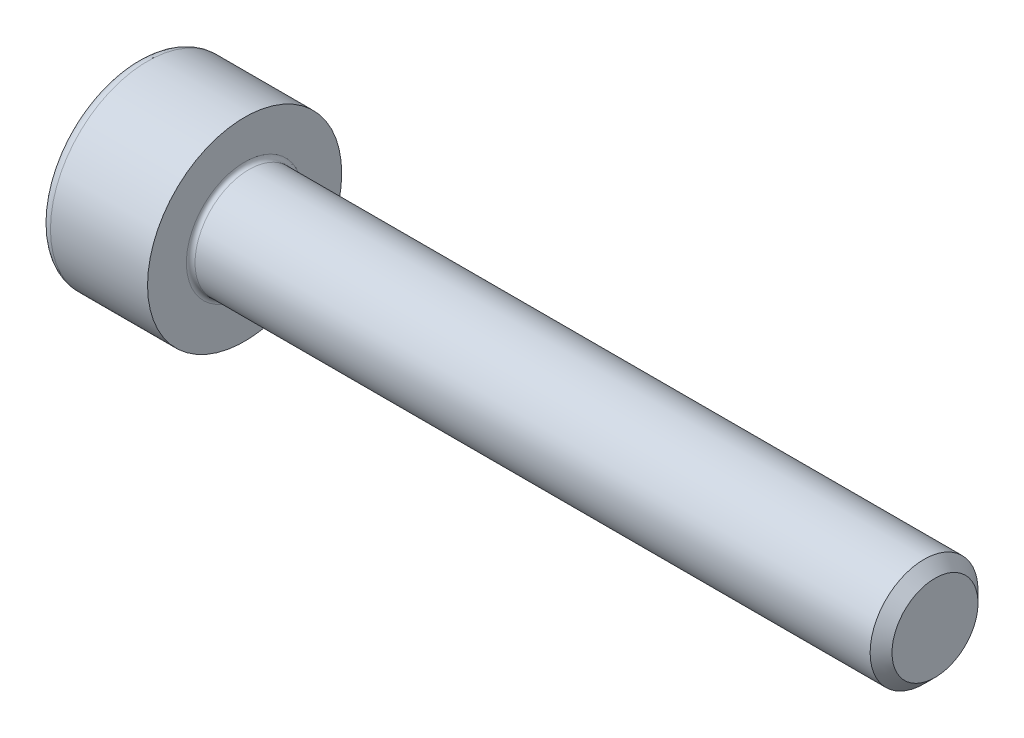
ISO-10303-21;
HEADER;
FILE_DESCRIPTION(('STEP AP214'),'2;1');
FILE_NAME('part.step','',(''),(''),'','','');
FILE_SCHEMA(('AUTOMOTIVE_DESIGN { 1 0 10303 214 1 1 1 1 }'));
ENDSEC;
DATA;
#1=APPLICATION_CONTEXT('core data for automotive mechanical design processes');
#2=APPLICATION_PROTOCOL_DEFINITION('international standard','automotive_design',2000,#1);
#3=PRODUCT_CONTEXT('',#1,'mechanical');
#4=PRODUCT('Part','Part','',(#3));
#5=PRODUCT_RELATED_PRODUCT_CATEGORY('part','',(#4));
#6=PRODUCT_DEFINITION_FORMATION('','',#4);
#7=PRODUCT_DEFINITION_CONTEXT('part definition',#1,'design');
#8=PRODUCT_DEFINITION('design','',#6,#7);
#9=PRODUCT_DEFINITION_SHAPE('','',#8);
#10=(LENGTH_UNIT() NAMED_UNIT(*) SI_UNIT(.MILLI.,.METRE.));
#11=(NAMED_UNIT(*) PLANE_ANGLE_UNIT() SI_UNIT($,.RADIAN.));
#12=(NAMED_UNIT(*) SI_UNIT($,.STERADIAN.) SOLID_ANGLE_UNIT());
#13=UNCERTAINTY_MEASURE_WITH_UNIT(LENGTH_MEASURE(1.E-05),#10,'distance_accuracy_value','');
#14=(GEOMETRIC_REPRESENTATION_CONTEXT(3) GLOBAL_UNCERTAINTY_ASSIGNED_CONTEXT((#13)) GLOBAL_UNIT_ASSIGNED_CONTEXT((#10,
#11,#12)) REPRESENTATION_CONTEXT('',''));
#15=CARTESIAN_POINT('',(0.,0.,0.));
#16=DIRECTION('',(0.,0.,1.));
#17=DIRECTION('',(1.,0.,0.));
#18=AXIS2_PLACEMENT_3D('',#15,#16,#17);
#19=CARTESIAN_POINT('',(0.,0.,0.));
#20=DIRECTION('',(-1.,0.,0.));
#21=DIRECTION('',(0.,0.,1.));
#22=AXIS2_PLACEMENT_3D('',#19,#20,#21);
#23=PLANE('',#22);
#24=DIRECTION('',(0.,-0.499999999999999,0.866025403784439));
#25=VECTOR('',#24,1.);
#26=CARTESIAN_POINT('',(0.,1.16624754376304,0.));
#27=LINE('',#26,#25);
#28=CARTESIAN_POINT('',(0.,1.16624754376304,0.));
#29=VERTEX_POINT('',#28);
#30=CARTESIAN_POINT('',(0.,0.583123771881518,1.01));
#31=VERTEX_POINT('',#30);
#32=EDGE_CURVE('E263',#29,#31,#27,.T.);
#33=ORIENTED_EDGE('',*,*,#32,.T.);
#34=DIRECTION('',(0.,1.,0.));
#35=VECTOR('',#34,1.);
#36=CARTESIAN_POINT('',(0.,-0.583123771881526,1.01));
#37=LINE('',#36,#35);
#38=CARTESIAN_POINT('',(0.,-0.583123771881526,1.01));
#39=VERTEX_POINT('',#38);
#40=EDGE_CURVE('E135',#39,#31,#37,.T.);
#41=ORIENTED_EDGE('',*,*,#40,.F.);
#42=DIRECTION('',(0.,-0.500000000000001,-0.866025403784438));
#43=VECTOR('',#42,1.);
#44=CARTESIAN_POINT('',(0.,-0.583123771881526,1.01));
#45=LINE('',#44,#43);
#46=CARTESIAN_POINT('',(0.,-1.16624754376305,0.));
#47=VERTEX_POINT('',#46);
#48=EDGE_CURVE('E266',#39,#47,#45,.T.);
#49=ORIENTED_EDGE('',*,*,#48,.T.);
#50=DIRECTION('',(0.,0.499999999999999,-0.866025403784439));
#51=VECTOR('',#50,1.);
#52=CARTESIAN_POINT('',(0.,-1.16624754376305,0.));
#53=LINE('',#52,#51);
#54=CARTESIAN_POINT('',(0.,-0.583123771881529,-1.01));
#55=VERTEX_POINT('',#54);
#56=EDGE_CURVE('E269',#47,#55,#53,.T.);
#57=ORIENTED_EDGE('',*,*,#56,.T.);
#58=DIRECTION('',(0.,-1.,0.));
#59=VECTOR('',#58,1.);
#60=CARTESIAN_POINT('',(0.,0.583123771881516,-1.01));
#61=LINE('',#60,#59);
#62=CARTESIAN_POINT('',(0.,0.583123771881516,-1.01));
#63=VERTEX_POINT('',#62);
#64=EDGE_CURVE('E272',#63,#55,#61,.T.);
#65=ORIENTED_EDGE('',*,*,#64,.F.);
#66=DIRECTION('',(0.,-0.500000000000001,-0.866025403784438));
#67=VECTOR('',#66,1.);
#68=CARTESIAN_POINT('',(0.,1.16624754376304,0.));
#69=LINE('',#68,#67);
#70=EDGE_CURVE('E130',#29,#63,#69,.T.);
#71=ORIENTED_EDGE('',*,*,#70,.F.);
#72=EDGE_LOOP('',(#33,#41,#49,#57,#65,#71));
#73=FACE_BOUND('',#72,.T.);
#74=CARTESIAN_POINT('',(0.,0.,0.));
#75=DIRECTION('',(-1.,0.,0.));
#76=DIRECTION('',(0.,0.,1.));
#77=AXIS2_PLACEMENT_3D('',#74,#75,#76);
#78=CIRCLE('',#77,2.);
#79=CARTESIAN_POINT('',(0.,0.,2.));
#80=VERTEX_POINT('',#79);
#81=EDGE_CURVE('E47',#80,#80,#78,.T.);
#82=ORIENTED_EDGE('',*,*,#81,.T.);
#83=EDGE_LOOP('',(#82));
#84=FACE_BOUND('',#83,.T.);
#85=ADVANCED_FACE('F39',(#73,#84),#23,.T.);
#86=CARTESIAN_POINT('',(-31.75,0.,0.));
#87=DIRECTION('',(-1.,0.,0.));
#88=DIRECTION('',(0.,0.,1.));
#89=AXIS2_PLACEMENT_3D('',#86,#87,#88);
#90=CYLINDRICAL_SURFACE('',#89,2.25);
#91=CARTESIAN_POINT('',(0.25,0.,0.));
#92=DIRECTION('',(-1.,0.,0.));
#93=DIRECTION('',(0.,0.,1.));
#94=AXIS2_PLACEMENT_3D('',#91,#92,#93);
#95=CIRCLE('',#94,2.25);
#96=CARTESIAN_POINT('',(0.25,0.,2.25));
#97=VERTEX_POINT('',#96);
#98=EDGE_CURVE('E11',#97,#97,#95,.F.);
#99=ORIENTED_EDGE('',*,*,#98,.T.);
#100=EDGE_LOOP('',(#99));
#101=FACE_BOUND('',#100,.T.);
#102=CARTESIAN_POINT('',(2.5,0.,0.));
#103=DIRECTION('',(-1.,0.,0.));
#104=DIRECTION('',(0.,0.,1.));
#105=AXIS2_PLACEMENT_3D('',#102,#103,#104);
#106=CIRCLE('',#105,2.25);
#107=CARTESIAN_POINT('',(2.5,0.,2.25));
#108=VERTEX_POINT('',#107);
#109=EDGE_CURVE('E153',#108,#108,#106,.T.);
#110=ORIENTED_EDGE('',*,*,#109,.T.);
#111=EDGE_LOOP('',(#110));
#112=FACE_BOUND('',#111,.T.);
#113=ADVANCED_FACE('F177',(#101,#112),#90,.T.);
#114=CARTESIAN_POINT('',(2.5,2.25,0.));
#115=DIRECTION('',(1.,0.,0.));
#116=DIRECTION('',(0.,0.,-1.));
#117=AXIS2_PLACEMENT_3D('',#114,#115,#116);
#118=PLANE('',#117);
#119=CARTESIAN_POINT('',(2.5,0.,0.));
#120=DIRECTION('',(1.,0.,0.));
#121=DIRECTION('',(0.,0.,-1.));
#122=AXIS2_PLACEMENT_3D('',#119,#120,#121);
#123=CIRCLE('',#122,1.34999999999999);
#124=CARTESIAN_POINT('',(2.5,0.,-1.34999999999999));
#125=VERTEX_POINT('',#124);
#126=EDGE_CURVE('E156',#125,#125,#123,.F.);
#127=ORIENTED_EDGE('',*,*,#126,.T.);
#128=EDGE_LOOP('',(#127));
#129=FACE_BOUND('',#128,.T.);
#130=ORIENTED_EDGE('',*,*,#109,.F.);
#131=EDGE_LOOP('',(#130));
#132=FACE_BOUND('',#131,.T.);
#133=ADVANCED_FACE('F183',(#129,#132),#118,.T.);
#134=CARTESIAN_POINT('',(-31.75,0.,0.));
#135=DIRECTION('',(-1.,0.,0.));
#136=DIRECTION('',(0.,0.,1.));
#137=AXIS2_PLACEMENT_3D('',#134,#135,#136);
#138=CYLINDRICAL_SURFACE('',#137,1.25);
#139=CARTESIAN_POINT('',(2.6,0.,0.));
#140=DIRECTION('',(1.,0.,0.));
#141=DIRECTION('',(0.,0.,-1.));
#142=AXIS2_PLACEMENT_3D('',#139,#140,#141);
#143=CIRCLE('',#142,1.25);
#144=CARTESIAN_POINT('',(2.6,0.,-1.25));
#145=VERTEX_POINT('',#144);
#146=EDGE_CURVE('E159',#145,#145,#143,.T.);
#147=ORIENTED_EDGE('',*,*,#146,.T.);
#148=EDGE_LOOP('',(#147));
#149=FACE_BOUND('',#148,.T.);
#150=CARTESIAN_POINT('',(18.2465,0.,0.));
#151=DIRECTION('',(-1.,0.,0.));
#152=DIRECTION('',(0.,0.,1.));
#153=AXIS2_PLACEMENT_3D('',#150,#151,#152);
#154=CIRCLE('',#153,1.24999999999999);
#155=CARTESIAN_POINT('',(18.2465,0.,1.24999999999999));
#156=VERTEX_POINT('',#155);
#157=EDGE_CURVE('E150',#156,#156,#154,.T.);
#158=ORIENTED_EDGE('',*,*,#157,.T.);
#159=EDGE_LOOP('',(#158));
#160=FACE_BOUND('',#159,.T.);
#161=ADVANCED_FACE('F189',(#149,#160),#138,.T.);
#162=CARTESIAN_POINT('',(18.5,0.,0.));
#163=DIRECTION('',(-1.,0.,0.));
#164=DIRECTION('',(0.,0.,1.));
#165=AXIS2_PLACEMENT_3D('',#162,#163,#164);
#166=CONICAL_SURFACE('',#165,0.9965,0.785398163397409);
#167=ORIENTED_EDGE('',*,*,#157,.F.);
#168=EDGE_LOOP('',(#167));
#169=FACE_BOUND('',#168,.T.);
#170=CARTESIAN_POINT('',(18.5,0.,0.));
#171=DIRECTION('',(-1.,0.,0.));
#172=DIRECTION('',(0.,0.,1.));
#173=AXIS2_PLACEMENT_3D('',#170,#171,#172);
#174=CIRCLE('',#173,0.9965);
#175=CARTESIAN_POINT('',(18.5,0.,0.9965));
#176=VERTEX_POINT('',#175);
#177=EDGE_CURVE('E146',#176,#176,#174,.T.);
#178=ORIENTED_EDGE('',*,*,#177,.T.);
#179=EDGE_LOOP('',(#178));
#180=FACE_BOUND('',#179,.T.);
#181=ADVANCED_FACE('F193',(#169,#180),#166,.T.);
#182=CARTESIAN_POINT('',(18.5,0.9965,0.));
#183=DIRECTION('',(1.,0.,0.));
#184=DIRECTION('',(0.,0.,-1.));
#185=AXIS2_PLACEMENT_3D('',#182,#183,#184);
#186=PLANE('',#185);
#187=ORIENTED_EDGE('',*,*,#177,.F.);
#188=EDGE_LOOP('',(#187));
#189=FACE_BOUND('',#188,.T.);
#190=ADVANCED_FACE('F173',(#189),#186,.T.);
#191=CARTESIAN_POINT('',(2.6,0.,0.));
#192=DIRECTION('',(1.,0.,0.));
#193=DIRECTION('',(0.,0.,-1.));
#194=AXIS2_PLACEMENT_3D('',#191,#192,#193);
#195=TOROIDAL_SURFACE('',#194,1.34999999999999,0.1);
#196=ORIENTED_EDGE('',*,*,#146,.F.);
#197=EDGE_LOOP('',(#196));
#198=FACE_BOUND('',#197,.T.);
#199=ORIENTED_EDGE('',*,*,#126,.F.);
#200=EDGE_LOOP('',(#199));
#201=FACE_BOUND('',#200,.T.);
#202=ADVANCED_FACE('F166',(#198,#201),#195,.F.);
#203=CARTESIAN_POINT('',(0.25,0.,0.));
#204=DIRECTION('',(-1.,0.,0.));
#205=DIRECTION('',(0.,0.,1.));
#206=AXIS2_PLACEMENT_3D('',#203,#204,#205);
#207=TOROIDAL_SURFACE('',#206,2.,0.25);
#208=ORIENTED_EDGE('',*,*,#98,.F.);
#209=EDGE_LOOP('',(#208));
#210=FACE_BOUND('',#209,.T.);
#211=ORIENTED_EDGE('',*,*,#81,.F.);
#212=EDGE_LOOP('',(#211));
#213=FACE_BOUND('',#212,.T.);
#214=ADVANCED_FACE('F41',(#210,#213),#207,.T.);
#215=CARTESIAN_POINT('',(1.1,1.16624754376304,0.));
#216=DIRECTION('',(0.,-0.866025403784439,-0.499999999999999));
#217=DIRECTION('',(0.,0.499999999999999,-0.866025403784439));
#218=AXIS2_PLACEMENT_3D('',#215,#216,#217);
#219=PLANE('',#218);
#220=ORIENTED_EDGE('',*,*,#32,.F.);
#221=DIRECTION('',(-1.,0.,0.));
#222=VECTOR('',#221,1.);
#223=CARTESIAN_POINT('',(1.1,1.16624754376304,0.));
#224=LINE('',#223,#222);
#225=CARTESIAN_POINT('',(1.1,1.16624754376304,0.));
#226=VERTEX_POINT('',#225);
#227=EDGE_CURVE('E253',#226,#29,#224,.T.);
#228=ORIENTED_EDGE('',*,*,#227,.F.);
#229=DIRECTION('',(0.,-0.499999999999999,0.866025403784439));
#230=VECTOR('',#229,1.);
#231=CARTESIAN_POINT('',(1.1,1.16624754376304,0.));
#232=LINE('',#231,#230);
#233=CARTESIAN_POINT('',(1.1,0.874685657822279,0.504999999999997));
#234=VERTEX_POINT('',#233);
#235=EDGE_CURVE('E122',#226,#234,#232,.T.);
#236=ORIENTED_EDGE('',*,*,#235,.T.);
#237=CARTESIAN_POINT('',(1.1,0.583123771881518,1.01));
#238=VERTEX_POINT('',#237);
#239=EDGE_CURVE('E113',#234,#238,#232,.T.);
#240=ORIENTED_EDGE('',*,*,#239,.T.);
#241=DIRECTION('',(-1.,0.,0.));
#242=VECTOR('',#241,1.);
#243=CARTESIAN_POINT('',(1.1,0.583123771881518,1.01));
#244=LINE('',#243,#242);
#245=EDGE_CURVE('E127',#238,#31,#244,.T.);
#246=ORIENTED_EDGE('',*,*,#245,.T.);
#247=EDGE_LOOP('',(#220,#228,#236,#240,#246));
#248=FACE_BOUND('',#247,.T.);
#249=ADVANCED_FACE('F126',(#248),#219,.T.);
#250=CARTESIAN_POINT('',(1.1,-0.583123771881526,1.01));
#251=DIRECTION('',(0.,0.,1.));
#252=DIRECTION('',(0.,-1.,0.));
#253=AXIS2_PLACEMENT_3D('',#250,#251,#252);
#254=PLANE('',#253);
#255=ORIENTED_EDGE('',*,*,#40,.T.);
#256=ORIENTED_EDGE('',*,*,#245,.F.);
#257=DIRECTION('',(0.,1.,0.));
#258=VECTOR('',#257,1.);
#259=CARTESIAN_POINT('',(1.1,-0.583123771881526,1.01));
#260=LINE('',#259,#258);
#261=CARTESIAN_POINT('',(1.1,0.,1.01));
#262=VERTEX_POINT('',#261);
#263=EDGE_CURVE('E110',#262,#238,#260,.T.);
#264=ORIENTED_EDGE('',*,*,#263,.F.);
#265=CARTESIAN_POINT('',(1.1,-0.583123771881526,1.01));
#266=VERTEX_POINT('',#265);
#267=EDGE_CURVE('E121',#266,#262,#260,.T.);
#268=ORIENTED_EDGE('',*,*,#267,.F.);
#269=DIRECTION('',(-1.,0.,0.));
#270=VECTOR('',#269,1.);
#271=CARTESIAN_POINT('',(1.1,-0.583123771881526,1.01));
#272=LINE('',#271,#270);
#273=EDGE_CURVE('E137',#266,#39,#272,.T.);
#274=ORIENTED_EDGE('',*,*,#273,.T.);
#275=EDGE_LOOP('',(#255,#256,#264,#268,#274));
#276=FACE_BOUND('',#275,.T.);
#277=ADVANCED_FACE('F132',(#276),#254,.F.);
#278=CARTESIAN_POINT('',(1.1,-0.583123771881526,1.01));
#279=DIRECTION('',(0.,0.866025403784438,-0.500000000000001));
#280=DIRECTION('',(0.,0.500000000000001,0.866025403784438));
#281=AXIS2_PLACEMENT_3D('',#278,#279,#280);
#282=PLANE('',#281);
#283=ORIENTED_EDGE('',*,*,#48,.F.);
#284=ORIENTED_EDGE('',*,*,#273,.F.);
#285=DIRECTION('',(0.,-0.500000000000001,-0.866025403784438));
#286=VECTOR('',#285,1.);
#287=CARTESIAN_POINT('',(1.1,-0.583123771881526,1.01));
#288=LINE('',#287,#286);
#289=CARTESIAN_POINT('',(1.1,-0.874685657822286,0.505000000000003));
#290=VERTEX_POINT('',#289);
#291=EDGE_CURVE('E292',#266,#290,#288,.T.);
#292=ORIENTED_EDGE('',*,*,#291,.T.);
#293=CARTESIAN_POINT('',(1.1,-1.16624754376305,0.));
#294=VERTEX_POINT('',#293);
#295=EDGE_CURVE('E281',#290,#294,#288,.T.);
#296=ORIENTED_EDGE('',*,*,#295,.T.);
#297=DIRECTION('',(-1.,0.,0.));
#298=VECTOR('',#297,1.);
#299=CARTESIAN_POINT('',(1.1,-1.16624754376305,0.));
#300=LINE('',#299,#298);
#301=EDGE_CURVE('E142',#294,#47,#300,.T.);
#302=ORIENTED_EDGE('',*,*,#301,.T.);
#303=EDGE_LOOP('',(#283,#284,#292,#296,#302));
#304=FACE_BOUND('',#303,.T.);
#305=ADVANCED_FACE('F207',(#304),#282,.T.);
#306=CARTESIAN_POINT('',(1.1,-1.16624754376305,0.));
#307=DIRECTION('',(0.,0.866025403784439,0.499999999999999));
#308=DIRECTION('',(0.,-0.499999999999999,0.866025403784439));
#309=AXIS2_PLACEMENT_3D('',#306,#307,#308);
#310=PLANE('',#309);
#311=ORIENTED_EDGE('',*,*,#56,.F.);
#312=ORIENTED_EDGE('',*,*,#301,.F.);
#313=DIRECTION('',(0.,0.499999999999999,-0.866025403784439));
#314=VECTOR('',#313,1.);
#315=CARTESIAN_POINT('',(1.1,-1.16624754376305,0.));
#316=LINE('',#315,#314);
#317=CARTESIAN_POINT('',(1.1,-0.874685657822289,-0.505000000000002));
#318=VERTEX_POINT('',#317);
#319=EDGE_CURVE('E259',#294,#318,#316,.T.);
#320=ORIENTED_EDGE('',*,*,#319,.T.);
#321=CARTESIAN_POINT('',(1.1,-0.583123771881529,-1.01));
#322=VERTEX_POINT('',#321);
#323=EDGE_CURVE('E291',#318,#322,#316,.T.);
#324=ORIENTED_EDGE('',*,*,#323,.T.);
#325=DIRECTION('',(-1.,0.,0.));
#326=VECTOR('',#325,1.);
#327=CARTESIAN_POINT('',(1.1,-0.583123771881529,-1.01));
#328=LINE('',#327,#326);
#329=EDGE_CURVE('E252',#322,#55,#328,.T.);
#330=ORIENTED_EDGE('',*,*,#329,.T.);
#331=EDGE_LOOP('',(#311,#312,#320,#324,#330));
#332=FACE_BOUND('',#331,.T.);
#333=ADVANCED_FACE('F210',(#332),#310,.T.);
#334=CARTESIAN_POINT('',(1.1,0.583123771881516,-1.01));
#335=DIRECTION('',(0.,0.,-1.));
#336=DIRECTION('',(0.,1.,0.));
#337=AXIS2_PLACEMENT_3D('',#334,#335,#336);
#338=PLANE('',#337);
#339=ORIENTED_EDGE('',*,*,#64,.T.);
#340=ORIENTED_EDGE('',*,*,#329,.F.);
#341=DIRECTION('',(0.,-1.,0.));
#342=VECTOR('',#341,1.);
#343=CARTESIAN_POINT('',(1.1,0.583123771881516,-1.01));
#344=LINE('',#343,#342);
#345=CARTESIAN_POINT('',(1.1,0.,-1.01));
#346=VERTEX_POINT('',#345);
#347=EDGE_CURVE('E256',#346,#322,#344,.T.);
#348=ORIENTED_EDGE('',*,*,#347,.F.);
#349=CARTESIAN_POINT('',(1.1,0.583123771881516,-1.01));
#350=VERTEX_POINT('',#349);
#351=EDGE_CURVE('E54',#350,#346,#344,.T.);
#352=ORIENTED_EDGE('',*,*,#351,.F.);
#353=DIRECTION('',(-1.,0.,0.));
#354=VECTOR('',#353,1.);
#355=CARTESIAN_POINT('',(1.1,0.583123771881516,-1.01));
#356=LINE('',#355,#354);
#357=EDGE_CURVE('E249',#350,#63,#356,.T.);
#358=ORIENTED_EDGE('',*,*,#357,.T.);
#359=EDGE_LOOP('',(#339,#340,#348,#352,#358));
#360=FACE_BOUND('',#359,.T.);
#361=ADVANCED_FACE('F214',(#360),#338,.F.);
#362=CARTESIAN_POINT('',(1.1,1.16624754376304,0.));
#363=DIRECTION('',(0.,0.866025403784438,-0.500000000000001));
#364=DIRECTION('',(0.,0.500000000000002,0.866025403784438));
#365=AXIS2_PLACEMENT_3D('',#362,#363,#364);
#366=PLANE('',#365);
#367=ORIENTED_EDGE('',*,*,#70,.T.);
#368=ORIENTED_EDGE('',*,*,#357,.F.);
#369=DIRECTION('',(0.,-0.500000000000001,-0.866025403784438));
#370=VECTOR('',#369,1.);
#371=CARTESIAN_POINT('',(1.1,1.16624754376304,0.));
#372=LINE('',#371,#370);
#373=CARTESIAN_POINT('',(1.1,0.874685657822279,-0.505));
#374=VERTEX_POINT('',#373);
#375=EDGE_CURVE('E239',#374,#350,#372,.T.);
#376=ORIENTED_EDGE('',*,*,#375,.F.);
#377=EDGE_CURVE('E245',#226,#374,#372,.T.);
#378=ORIENTED_EDGE('',*,*,#377,.F.);
#379=ORIENTED_EDGE('',*,*,#227,.T.);
#380=EDGE_LOOP('',(#367,#368,#376,#378,#379));
#381=FACE_BOUND('',#380,.T.);
#382=ADVANCED_FACE('F218',(#381),#366,.F.);
#383=CARTESIAN_POINT('',(1.1,1.16624754376304,0.));
#384=DIRECTION('',(1.,0.,0.));
#385=DIRECTION('',(0.,0.,-1.));
#386=AXIS2_PLACEMENT_3D('',#383,#384,#385);
#387=PLANE('',#386);
#388=ORIENTED_EDGE('',*,*,#347,.T.);
#389=ORIENTED_EDGE('',*,*,#323,.F.);
#390=CARTESIAN_POINT('',(1.1,0.,0.));
#391=DIRECTION('',(-1.,0.,0.));
#392=DIRECTION('',(0.,0.,1.));
#393=AXIS2_PLACEMENT_3D('',#390,#391,#392);
#394=CIRCLE('',#393,1.01);
#395=EDGE_CURVE('E287',#346,#318,#394,.T.);
#396=ORIENTED_EDGE('',*,*,#395,.F.);
#397=EDGE_LOOP('',(#388,#389,#396));
#398=FACE_BOUND('',#397,.T.);
#399=ADVANCED_FACE('F222',(#398),#387,.F.);
#400=ORIENTED_EDGE('',*,*,#319,.F.);
#401=ORIENTED_EDGE('',*,*,#295,.F.);
#402=EDGE_CURVE('E140',#318,#290,#394,.T.);
#403=ORIENTED_EDGE('',*,*,#402,.F.);
#404=EDGE_LOOP('',(#400,#401,#403));
#405=FACE_BOUND('',#404,.T.);
#406=ADVANCED_FACE('F225',(#405),#387,.F.);
#407=ORIENTED_EDGE('',*,*,#291,.F.);
#408=ORIENTED_EDGE('',*,*,#267,.T.);
#409=EDGE_CURVE('E136',#290,#262,#394,.T.);
#410=ORIENTED_EDGE('',*,*,#409,.F.);
#411=EDGE_LOOP('',(#407,#408,#410));
#412=FACE_BOUND('',#411,.T.);
#413=ADVANCED_FACE('F230',(#412),#387,.F.);
#414=ORIENTED_EDGE('',*,*,#263,.T.);
#415=ORIENTED_EDGE('',*,*,#239,.F.);
#416=EDGE_CURVE('E116',#262,#234,#394,.T.);
#417=ORIENTED_EDGE('',*,*,#416,.F.);
#418=EDGE_LOOP('',(#414,#415,#417));
#419=FACE_BOUND('',#418,.T.);
#420=ADVANCED_FACE('F112',(#419),#387,.F.);
#421=ORIENTED_EDGE('',*,*,#235,.F.);
#422=ORIENTED_EDGE('',*,*,#377,.T.);
#423=EDGE_CURVE('E147',#234,#374,#394,.T.);
#424=ORIENTED_EDGE('',*,*,#423,.F.);
#425=EDGE_LOOP('',(#421,#422,#424));
#426=FACE_BOUND('',#425,.T.);
#427=ADVANCED_FACE('F233',(#426),#387,.F.);
#428=ORIENTED_EDGE('',*,*,#375,.T.);
#429=ORIENTED_EDGE('',*,*,#351,.T.);
#430=EDGE_CURVE('E242',#374,#346,#394,.T.);
#431=ORIENTED_EDGE('',*,*,#430,.F.);
#432=EDGE_LOOP('',(#428,#429,#431));
#433=FACE_BOUND('',#432,.T.);
#434=ADVANCED_FACE('F203',(#433),#387,.F.);
#435=CARTESIAN_POINT('',(1.1,0.,0.));
#436=DIRECTION('',(-1.,0.,0.));
#437=DIRECTION('',(0.,0.,1.));
#438=AXIS2_PLACEMENT_3D('',#435,#436,#437);
#439=CONICAL_SURFACE('',#438,1.01,1.0471975511966);
#440=CARTESIAN_POINT('',(1.68312377188153,0.,0.));
#441=VERTEX_POINT('',#440);
#442=VERTEX_LOOP('',#441);
#443=FACE_BOUND('',#442,.T.);
#444=ORIENTED_EDGE('',*,*,#416,.T.);
#445=ORIENTED_EDGE('',*,*,#423,.T.);
#446=ORIENTED_EDGE('',*,*,#430,.T.);
#447=ORIENTED_EDGE('',*,*,#395,.T.);
#448=ORIENTED_EDGE('',*,*,#402,.T.);
#449=ORIENTED_EDGE('',*,*,#409,.T.);
#450=EDGE_LOOP('',(#444,#445,#446,#447,#448,#449));
#451=FACE_BOUND('',#450,.T.);
#452=ADVANCED_FACE('F201',(#443,#451),#439,.F.);
#453=CLOSED_SHELL('',(#85,#113,#133,#161,#181,#190,#202,#214,#249,#277,#305,#333,#361,#382,#399,
#406,#413,#420,#427,#434,#452));
#454=MANIFOLD_SOLID_BREP('B2',#453);
#455=ADVANCED_BREP_SHAPE_REPRESENTATION('',(#18,#454),#14);
#456=SHAPE_DEFINITION_REPRESENTATION(#9,#455);
ENDSEC;
END-ISO-10303-21;
